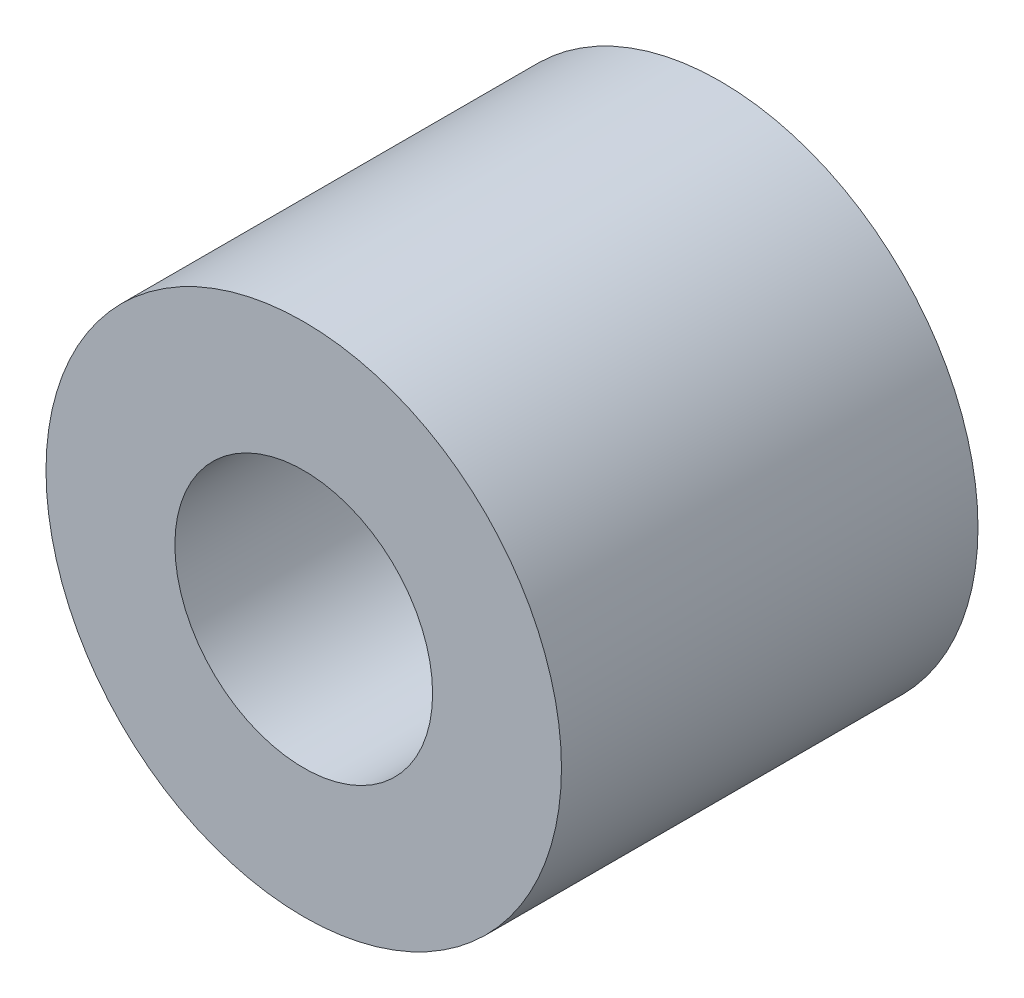
ISO-10303-21;
HEADER;
FILE_DESCRIPTION(('STEP AP214'),'2;1');
FILE_NAME('part.step','',(''),(''),'','','');
FILE_SCHEMA(('AUTOMOTIVE_DESIGN { 1 0 10303 214 1 1 1 1 }'));
ENDSEC;
DATA;
#1=APPLICATION_CONTEXT('core data for automotive mechanical design processes');
#2=APPLICATION_PROTOCOL_DEFINITION('international standard','automotive_design',2000,#1);
#3=PRODUCT_CONTEXT('',#1,'mechanical');
#4=PRODUCT('Part','Part','',(#3));
#5=PRODUCT_RELATED_PRODUCT_CATEGORY('part','',(#4));
#6=PRODUCT_DEFINITION_FORMATION('','',#4);
#7=PRODUCT_DEFINITION_CONTEXT('part definition',#1,'design');
#8=PRODUCT_DEFINITION('design','',#6,#7);
#9=PRODUCT_DEFINITION_SHAPE('','',#8);
#10=(LENGTH_UNIT() NAMED_UNIT(*) SI_UNIT(.MILLI.,.METRE.));
#11=(NAMED_UNIT(*) PLANE_ANGLE_UNIT() SI_UNIT($,.RADIAN.));
#12=(NAMED_UNIT(*) SI_UNIT($,.STERADIAN.) SOLID_ANGLE_UNIT());
#13=UNCERTAINTY_MEASURE_WITH_UNIT(LENGTH_MEASURE(1.E-05),#10,'distance_accuracy_value','');
#14=(GEOMETRIC_REPRESENTATION_CONTEXT(3) GLOBAL_UNCERTAINTY_ASSIGNED_CONTEXT((#13)) GLOBAL_UNIT_ASSIGNED_CONTEXT((#10,
#11,#12)) REPRESENTATION_CONTEXT('',''));
#15=CARTESIAN_POINT('',(0.,0.,0.));
#16=DIRECTION('',(0.,0.,1.));
#17=DIRECTION('',(1.,0.,0.));
#18=AXIS2_PLACEMENT_3D('',#15,#16,#17);
#19=CARTESIAN_POINT('',(0.,0.,4.));
#20=DIRECTION('',(0.,0.,-1.));
#21=DIRECTION('',(-1.,0.,0.));
#22=AXIS2_PLACEMENT_3D('',#19,#20,#21);
#23=CYLINDRICAL_SURFACE('',#22,2.475);
#24=CARTESIAN_POINT('',(0.,0.,-4.));
#25=DIRECTION('',(0.,0.,-1.));
#26=DIRECTION('',(-1.,0.,0.));
#27=AXIS2_PLACEMENT_3D('',#24,#25,#26);
#28=CIRCLE('',#27,2.475);
#29=CARTESIAN_POINT('',(-2.475,0.,-4.));
#30=VERTEX_POINT('',#29);
#31=EDGE_CURVE('E18',#30,#30,#28,.T.);
#32=ORIENTED_EDGE('',*,*,#31,.T.);
#33=EDGE_LOOP('',(#32));
#34=FACE_BOUND('',#33,.T.);
#35=CARTESIAN_POINT('',(0.,0.,4.));
#36=DIRECTION('',(0.,0.,-1.));
#37=DIRECTION('',(-1.,0.,0.));
#38=AXIS2_PLACEMENT_3D('',#35,#36,#37);
#39=CIRCLE('',#38,2.475);
#40=CARTESIAN_POINT('',(-2.475,0.,4.));
#41=VERTEX_POINT('',#40);
#42=EDGE_CURVE('E27',#41,#41,#39,.T.);
#43=ORIENTED_EDGE('',*,*,#42,.F.);
#44=EDGE_LOOP('',(#43));
#45=FACE_BOUND('',#44,.T.);
#46=ADVANCED_FACE('F15',(#34,#45),#23,.F.);
#47=CARTESIAN_POINT('',(0.,0.,-4.));
#48=DIRECTION('',(0.,0.,1.));
#49=DIRECTION('',(1.,0.,0.));
#50=AXIS2_PLACEMENT_3D('',#47,#48,#49);
#51=PLANE('',#50);
#52=ORIENTED_EDGE('',*,*,#31,.F.);
#53=EDGE_LOOP('',(#52));
#54=FACE_BOUND('',#53,.T.);
#55=CARTESIAN_POINT('',(0.,0.,-4.));
#56=DIRECTION('',(0.,0.,-1.));
#57=DIRECTION('',(-1.,0.,0.));
#58=AXIS2_PLACEMENT_3D('',#55,#56,#57);
#59=CIRCLE('',#58,4.95);
#60=CARTESIAN_POINT('',(-4.95,0.,-4.));
#61=VERTEX_POINT('',#60);
#62=EDGE_CURVE('E22',#61,#61,#59,.F.);
#63=ORIENTED_EDGE('',*,*,#62,.F.);
#64=EDGE_LOOP('',(#63));
#65=FACE_BOUND('',#64,.T.);
#66=ADVANCED_FACE('F37',(#54,#65),#51,.F.);
#67=CARTESIAN_POINT('',(0.,0.,4.));
#68=DIRECTION('',(0.,0.,1.));
#69=DIRECTION('',(1.,0.,0.));
#70=AXIS2_PLACEMENT_3D('',#67,#68,#69);
#71=PLANE('',#70);
#72=ORIENTED_EDGE('',*,*,#42,.T.);
#73=EDGE_LOOP('',(#72));
#74=FACE_BOUND('',#73,.T.);
#75=CARTESIAN_POINT('',(0.,0.,4.));
#76=DIRECTION('',(0.,0.,-1.));
#77=DIRECTION('',(-1.,0.,0.));
#78=AXIS2_PLACEMENT_3D('',#75,#76,#77);
#79=CIRCLE('',#78,4.95);
#80=CARTESIAN_POINT('',(-4.95,0.,4.));
#81=VERTEX_POINT('',#80);
#82=EDGE_CURVE('E10',#81,#81,#79,.T.);
#83=ORIENTED_EDGE('',*,*,#82,.F.);
#84=EDGE_LOOP('',(#83));
#85=FACE_BOUND('',#84,.T.);
#86=ADVANCED_FACE('F40',(#74,#85),#71,.T.);
#87=CARTESIAN_POINT('',(0.,0.,4.));
#88=DIRECTION('',(0.,0.,-1.));
#89=DIRECTION('',(-1.,0.,0.));
#90=AXIS2_PLACEMENT_3D('',#87,#88,#89);
#91=CYLINDRICAL_SURFACE('',#90,4.95);
#92=ORIENTED_EDGE('',*,*,#82,.T.);
#93=EDGE_LOOP('',(#92));
#94=FACE_BOUND('',#93,.T.);
#95=ORIENTED_EDGE('',*,*,#62,.T.);
#96=EDGE_LOOP('',(#95));
#97=FACE_BOUND('',#96,.T.);
#98=ADVANCED_FACE('F43',(#94,#97),#91,.T.);
#99=CLOSED_SHELL('',(#46,#66,#86,#98));
#100=MANIFOLD_SOLID_BREP('B1',#99);
#101=ADVANCED_BREP_SHAPE_REPRESENTATION('',(#18,#100),#14);
#102=SHAPE_DEFINITION_REPRESENTATION(#9,#101);
ENDSEC;
END-ISO-10303-21;
